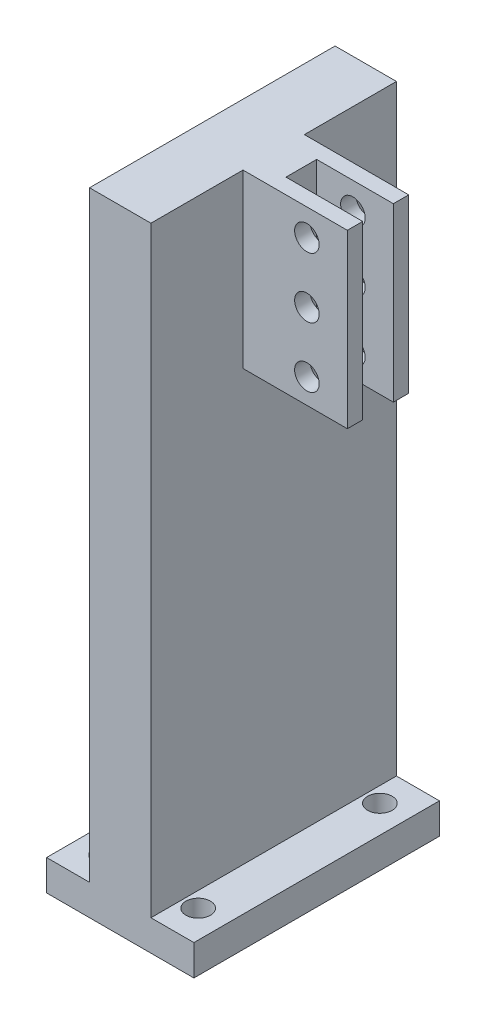
ISO-10303-21;
HEADER;
FILE_DESCRIPTION(('STEP AP214'),'2;1');
FILE_NAME('part.step','',(''),(''),'','','');
FILE_SCHEMA(('AUTOMOTIVE_DESIGN { 1 0 10303 214 1 1 1 1 }'));
ENDSEC;
DATA;
#1=APPLICATION_CONTEXT('core data for automotive mechanical design processes');
#2=APPLICATION_PROTOCOL_DEFINITION('international standard','automotive_design',2000,#1);
#3=PRODUCT_CONTEXT('',#1,'mechanical');
#4=PRODUCT('Part','Part','',(#3));
#5=PRODUCT_RELATED_PRODUCT_CATEGORY('part','',(#4));
#6=PRODUCT_DEFINITION_FORMATION('','',#4);
#7=PRODUCT_DEFINITION_CONTEXT('part definition',#1,'design');
#8=PRODUCT_DEFINITION('design','',#6,#7);
#9=PRODUCT_DEFINITION_SHAPE('','',#8);
#10=(LENGTH_UNIT() NAMED_UNIT(*) SI_UNIT(.MILLI.,.METRE.));
#11=(NAMED_UNIT(*) PLANE_ANGLE_UNIT() SI_UNIT($,.RADIAN.));
#12=(NAMED_UNIT(*) SI_UNIT($,.STERADIAN.) SOLID_ANGLE_UNIT());
#13=UNCERTAINTY_MEASURE_WITH_UNIT(LENGTH_MEASURE(1.E-05),#10,'distance_accuracy_value','');
#14=(GEOMETRIC_REPRESENTATION_CONTEXT(3) GLOBAL_UNCERTAINTY_ASSIGNED_CONTEXT((#13)) GLOBAL_UNIT_ASSIGNED_CONTEXT((#10,
#11,#12)) REPRESENTATION_CONTEXT('',''));
#15=CARTESIAN_POINT('',(0.,0.,0.));
#16=DIRECTION('',(0.,0.,1.));
#17=DIRECTION('',(1.,0.,0.));
#18=AXIS2_PLACEMENT_3D('',#15,#16,#17);
#19=CARTESIAN_POINT('',(0.,103.,0.));
#20=DIRECTION('',(0.,1.,0.));
#21=DIRECTION('',(0.,0.,1.));
#22=AXIS2_PLACEMENT_3D('',#19,#20,#21);
#23=PLANE('',#22);
#24=DIRECTION('',(0.,0.,1.));
#25=VECTOR('',#24,1.);
#26=CARTESIAN_POINT('',(9.5,103.,-2.));
#27=LINE('',#26,#25);
#28=CARTESIAN_POINT('',(9.5,103.,-2.5));
#29=VERTEX_POINT('',#28);
#30=CARTESIAN_POINT('',(9.5,103.,2.5));
#31=VERTEX_POINT('',#30);
#32=EDGE_CURVE('E160',#29,#31,#27,.T.);
#33=ORIENTED_EDGE('',*,*,#32,.F.);
#34=DIRECTION('',(-1.,0.,0.));
#35=VECTOR('',#34,1.);
#36=CARTESIAN_POINT('',(9.5,103.,-2.5));
#37=LINE('',#36,#35);
#38=CARTESIAN_POINT('',(22.,103.,-2.5));
#39=VERTEX_POINT('',#38);
#40=EDGE_CURVE('E151',#39,#29,#37,.T.);
#41=ORIENTED_EDGE('',*,*,#40,.F.);
#42=DIRECTION('',(0.,0.,1.));
#43=VECTOR('',#42,1.);
#44=CARTESIAN_POINT('',(22.,103.,5.));
#45=LINE('',#44,#43);
#46=CARTESIAN_POINT('',(22.,103.,-5.));
#47=VERTEX_POINT('',#46);
#48=EDGE_CURVE('E158',#47,#39,#45,.T.);
#49=ORIENTED_EDGE('',*,*,#48,.F.);
#50=DIRECTION('',(-1.,0.,0.));
#51=VECTOR('',#50,1.);
#52=CARTESIAN_POINT('',(23.5,103.,-5.));
#53=LINE('',#52,#51);
#54=CARTESIAN_POINT('',(5.,103.,-5.));
#55=VERTEX_POINT('',#54);
#56=EDGE_CURVE('E208',#47,#55,#53,.T.);
#57=ORIENTED_EDGE('',*,*,#56,.T.);
#58=DIRECTION('',(0.,0.,-1.));
#59=VECTOR('',#58,1.);
#60=CARTESIAN_POINT('',(5.,103.,20.));
#61=LINE('',#60,#59);
#62=CARTESIAN_POINT('',(5.,103.,-20.));
#63=VERTEX_POINT('',#62);
#64=EDGE_CURVE('E214',#55,#63,#61,.T.);
#65=ORIENTED_EDGE('',*,*,#64,.T.);
#66=DIRECTION('',(-1.,0.,0.));
#67=VECTOR('',#66,1.);
#68=CARTESIAN_POINT('',(5.,103.,-20.));
#69=LINE('',#68,#67);
#70=CARTESIAN_POINT('',(-5.,103.,-20.));
#71=VERTEX_POINT('',#70);
#72=EDGE_CURVE('E219',#63,#71,#69,.T.);
#73=ORIENTED_EDGE('',*,*,#72,.T.);
#74=DIRECTION('',(0.,0.,1.));
#75=VECTOR('',#74,1.);
#76=CARTESIAN_POINT('',(-5.,103.,-20.));
#77=LINE('',#76,#75);
#78=CARTESIAN_POINT('',(-5.,103.,20.));
#79=VERTEX_POINT('',#78);
#80=EDGE_CURVE('E221',#71,#79,#77,.T.);
#81=ORIENTED_EDGE('',*,*,#80,.T.);
#82=DIRECTION('',(1.,0.,0.));
#83=VECTOR('',#82,1.);
#84=CARTESIAN_POINT('',(-5.,103.,20.));
#85=LINE('',#84,#83);
#86=CARTESIAN_POINT('',(5.,103.,20.));
#87=VERTEX_POINT('',#86);
#88=EDGE_CURVE('E211',#79,#87,#85,.T.);
#89=ORIENTED_EDGE('',*,*,#88,.T.);
#90=CARTESIAN_POINT('',(5.,103.,5.));
#91=VERTEX_POINT('',#90);
#92=EDGE_CURVE('E216',#87,#91,#61,.T.);
#93=ORIENTED_EDGE('',*,*,#92,.T.);
#94=DIRECTION('',(-1.,0.,0.));
#95=VECTOR('',#94,1.);
#96=CARTESIAN_POINT('',(23.5,103.,5.));
#97=LINE('',#96,#95);
#98=CARTESIAN_POINT('',(22.,103.,5.));
#99=VERTEX_POINT('',#98);
#100=EDGE_CURVE('E206',#99,#91,#97,.T.);
#101=ORIENTED_EDGE('',*,*,#100,.F.);
#102=CARTESIAN_POINT('',(22.,103.,2.5));
#103=VERTEX_POINT('',#102);
#104=EDGE_CURVE('E168',#103,#99,#45,.T.);
#105=ORIENTED_EDGE('',*,*,#104,.F.);
#106=DIRECTION('',(1.,0.,0.));
#107=VECTOR('',#106,1.);
#108=CARTESIAN_POINT('',(9.5,103.,2.5));
#109=LINE('',#108,#107);
#110=EDGE_CURVE('E52',#31,#103,#109,.T.);
#111=ORIENTED_EDGE('',*,*,#110,.F.);
#112=EDGE_LOOP('',(#33,#41,#49,#57,#65,#73,#81,#89,#93,#101,#105,#111));
#113=FACE_BOUND('',#112,.T.);
#114=ADVANCED_FACE('F37',(#113),#23,.T.);
#115=CARTESIAN_POINT('',(23.5,75.,-5.));
#116=DIRECTION('',(0.,1.,0.));
#117=DIRECTION('',(0.,0.,1.));
#118=AXIS2_PLACEMENT_3D('',#115,#116,#117);
#119=PLANE('',#118);
#120=DIRECTION('',(-1.,0.,0.));
#121=VECTOR('',#120,1.);
#122=CARTESIAN_POINT('',(23.5,75.,-2.5));
#123=LINE('',#122,#121);
#124=CARTESIAN_POINT('',(22.,75.,-2.5));
#125=VERTEX_POINT('',#124);
#126=CARTESIAN_POINT('',(9.5,75.,-2.5));
#127=VERTEX_POINT('',#126);
#128=EDGE_CURVE('E59',#125,#127,#123,.T.);
#129=ORIENTED_EDGE('',*,*,#128,.T.);
#130=DIRECTION('',(0.,0.,1.));
#131=VECTOR('',#130,1.);
#132=CARTESIAN_POINT('',(9.5,75.,-5.));
#133=LINE('',#132,#131);
#134=CARTESIAN_POINT('',(9.5,75.,2.5));
#135=VERTEX_POINT('',#134);
#136=EDGE_CURVE('E155',#127,#135,#133,.T.);
#137=ORIENTED_EDGE('',*,*,#136,.T.);
#138=DIRECTION('',(1.,0.,0.));
#139=VECTOR('',#138,1.);
#140=CARTESIAN_POINT('',(23.5,75.,2.5));
#141=LINE('',#140,#139);
#142=CARTESIAN_POINT('',(22.,75.,2.5));
#143=VERTEX_POINT('',#142);
#144=EDGE_CURVE('E172',#135,#143,#141,.T.);
#145=ORIENTED_EDGE('',*,*,#144,.T.);
#146=DIRECTION('',(0.,0.,1.));
#147=VECTOR('',#146,1.);
#148=CARTESIAN_POINT('',(22.,75.,-5.));
#149=LINE('',#148,#147);
#150=CARTESIAN_POINT('',(22.,75.,5.));
#151=VERTEX_POINT('',#150);
#152=EDGE_CURVE('E178',#143,#151,#149,.T.);
#153=ORIENTED_EDGE('',*,*,#152,.T.);
#154=DIRECTION('',(-1.,0.,0.));
#155=VECTOR('',#154,1.);
#156=CARTESIAN_POINT('',(23.5,75.,5.));
#157=LINE('',#156,#155);
#158=CARTESIAN_POINT('',(5.,75.,5.));
#159=VERTEX_POINT('',#158);
#160=EDGE_CURVE('E204',#151,#159,#157,.T.);
#161=ORIENTED_EDGE('',*,*,#160,.T.);
#162=DIRECTION('',(0.,0.,-1.));
#163=VECTOR('',#162,1.);
#164=CARTESIAN_POINT('',(5.,75.,-5.));
#165=LINE('',#164,#163);
#166=CARTESIAN_POINT('',(5.,75.,-5.));
#167=VERTEX_POINT('',#166);
#168=EDGE_CURVE('E199',#159,#167,#165,.T.);
#169=ORIENTED_EDGE('',*,*,#168,.T.);
#170=DIRECTION('',(-1.,0.,0.));
#171=VECTOR('',#170,1.);
#172=CARTESIAN_POINT('',(23.5,75.,-5.));
#173=LINE('',#172,#171);
#174=CARTESIAN_POINT('',(22.,75.,-5.));
#175=VERTEX_POINT('',#174);
#176=EDGE_CURVE('E202',#175,#167,#173,.T.);
#177=ORIENTED_EDGE('',*,*,#176,.F.);
#178=EDGE_CURVE('E180',#175,#125,#149,.T.);
#179=ORIENTED_EDGE('',*,*,#178,.T.);
#180=EDGE_LOOP('',(#129,#137,#145,#153,#161,#169,#177,#179));
#181=FACE_BOUND('',#180,.T.);
#182=ADVANCED_FACE('F304',(#181),#119,.F.);
#183=CARTESIAN_POINT('',(15.41,79.03,19.25));
#184=DIRECTION('',(0.,0.,-1.));
#185=DIRECTION('',(0.,1.,0.));
#186=AXIS2_PLACEMENT_3D('',#183,#184,#185);
#187=CYLINDRICAL_SURFACE('',#186,2.);
#188=CARTESIAN_POINT('',(15.41,79.03,-2.5));
#189=DIRECTION('',(0.,0.,-1.));
#190=DIRECTION('',(-1.,0.,0.));
#191=AXIS2_PLACEMENT_3D('',#188,#189,#190);
#192=CIRCLE('',#191,2.);
#193=CARTESIAN_POINT('',(13.41,79.03,-2.5));
#194=VERTEX_POINT('',#193);
#195=EDGE_CURVE('E321',#194,#194,#192,.F.);
#196=ORIENTED_EDGE('',*,*,#195,.T.);
#197=EDGE_LOOP('',(#196));
#198=FACE_BOUND('',#197,.T.);
#199=CARTESIAN_POINT('',(15.41,79.03,-5.));
#200=DIRECTION('',(0.,0.,1.));
#201=DIRECTION('',(0.,-1.,0.));
#202=AXIS2_PLACEMENT_3D('',#199,#200,#201);
#203=CIRCLE('',#202,2.);
#204=CARTESIAN_POINT('',(15.41,77.03,-5.));
#205=VERTEX_POINT('',#204);
#206=EDGE_CURVE('E181',#205,#205,#203,.T.);
#207=ORIENTED_EDGE('',*,*,#206,.F.);
#208=EDGE_LOOP('',(#207));
#209=FACE_BOUND('',#208,.T.);
#210=ADVANCED_FACE('F353',(#198,#209),#187,.F.);
#211=CARTESIAN_POINT('',(15.41,88.85,19.25));
#212=DIRECTION('',(0.,0.,-1.));
#213=DIRECTION('',(0.,1.,0.));
#214=AXIS2_PLACEMENT_3D('',#211,#212,#213);
#215=CYLINDRICAL_SURFACE('',#214,2.);
#216=CARTESIAN_POINT('',(15.41,88.85,-2.5));
#217=DIRECTION('',(0.,0.,-1.));
#218=DIRECTION('',(-1.,0.,0.));
#219=AXIS2_PLACEMENT_3D('',#216,#217,#218);
#220=CIRCLE('',#219,2.);
#221=CARTESIAN_POINT('',(13.41,88.85,-2.5));
#222=VERTEX_POINT('',#221);
#223=EDGE_CURVE('E318',#222,#222,#220,.F.);
#224=ORIENTED_EDGE('',*,*,#223,.T.);
#225=EDGE_LOOP('',(#224));
#226=FACE_BOUND('',#225,.T.);
#227=CARTESIAN_POINT('',(15.41,88.85,-5.));
#228=DIRECTION('',(0.,0.,1.));
#229=DIRECTION('',(0.,-1.,0.));
#230=AXIS2_PLACEMENT_3D('',#227,#228,#229);
#231=CIRCLE('',#230,2.);
#232=CARTESIAN_POINT('',(15.41,86.85,-5.));
#233=VERTEX_POINT('',#232);
#234=EDGE_CURVE('E186',#233,#233,#231,.T.);
#235=ORIENTED_EDGE('',*,*,#234,.F.);
#236=EDGE_LOOP('',(#235));
#237=FACE_BOUND('',#236,.T.);
#238=ADVANCED_FACE('F459',(#226,#237),#215,.F.);
#239=CARTESIAN_POINT('',(15.41,98.67,19.25));
#240=DIRECTION('',(0.,0.,-1.));
#241=DIRECTION('',(0.,1.,0.));
#242=AXIS2_PLACEMENT_3D('',#239,#240,#241);
#243=CYLINDRICAL_SURFACE('',#242,2.);
#244=CARTESIAN_POINT('',(15.41,98.67,-2.5));
#245=DIRECTION('',(0.,0.,-1.));
#246=DIRECTION('',(-1.,0.,0.));
#247=AXIS2_PLACEMENT_3D('',#244,#245,#246);
#248=CIRCLE('',#247,2.);
#249=CARTESIAN_POINT('',(13.41,98.67,-2.5));
#250=VERTEX_POINT('',#249);
#251=EDGE_CURVE('E315',#250,#250,#248,.F.);
#252=ORIENTED_EDGE('',*,*,#251,.T.);
#253=EDGE_LOOP('',(#252));
#254=FACE_BOUND('',#253,.T.);
#255=CARTESIAN_POINT('',(15.41,98.67,-5.));
#256=DIRECTION('',(0.,0.,1.));
#257=DIRECTION('',(0.,-1.,0.));
#258=AXIS2_PLACEMENT_3D('',#255,#256,#257);
#259=CIRCLE('',#258,2.);
#260=CARTESIAN_POINT('',(15.41,96.67,-5.));
#261=VERTEX_POINT('',#260);
#262=EDGE_CURVE('E190',#261,#261,#259,.T.);
#263=ORIENTED_EDGE('',*,*,#262,.F.);
#264=EDGE_LOOP('',(#263));
#265=FACE_BOUND('',#264,.T.);
#266=ADVANCED_FACE('F368',(#254,#265),#243,.F.);
#267=CARTESIAN_POINT('',(5.,103.,20.));
#268=DIRECTION('',(-1.,0.,0.));
#269=DIRECTION('',(0.,0.,1.));
#270=AXIS2_PLACEMENT_3D('',#267,#268,#269);
#271=PLANE('',#270);
#272=DIRECTION('',(0.,1.,0.));
#273=VECTOR('',#272,1.);
#274=CARTESIAN_POINT('',(5.,103.,-5.));
#275=LINE('',#274,#273);
#276=EDGE_CURVE('E193',#167,#55,#275,.T.);
#277=ORIENTED_EDGE('',*,*,#276,.F.);
#278=ORIENTED_EDGE('',*,*,#168,.F.);
#279=DIRECTION('',(0.,-1.,0.));
#280=VECTOR('',#279,1.);
#281=CARTESIAN_POINT('',(5.,75.,5.));
#282=LINE('',#281,#280);
#283=EDGE_CURVE('E196',#91,#159,#282,.T.);
#284=ORIENTED_EDGE('',*,*,#283,.F.);
#285=ORIENTED_EDGE('',*,*,#92,.F.);
#286=DIRECTION('',(0.,-1.,0.));
#287=VECTOR('',#286,1.);
#288=CARTESIAN_POINT('',(5.,103.,20.));
#289=LINE('',#288,#287);
#290=CARTESIAN_POINT('',(5.,5.,20.));
#291=VERTEX_POINT('',#290);
#292=EDGE_CURVE('E236',#87,#291,#289,.T.);
#293=ORIENTED_EDGE('',*,*,#292,.T.);
#294=DIRECTION('',(0.,0.,-1.));
#295=VECTOR('',#294,1.);
#296=CARTESIAN_POINT('',(5.,5.,20.));
#297=LINE('',#296,#295);
#298=CARTESIAN_POINT('',(5.,5.,-20.));
#299=VERTEX_POINT('',#298);
#300=EDGE_CURVE('E210',#291,#299,#297,.T.);
#301=ORIENTED_EDGE('',*,*,#300,.T.);
#302=DIRECTION('',(0.,-1.,0.));
#303=VECTOR('',#302,1.);
#304=CARTESIAN_POINT('',(5.,103.,-20.));
#305=LINE('',#304,#303);
#306=EDGE_CURVE('E233',#63,#299,#305,.T.);
#307=ORIENTED_EDGE('',*,*,#306,.F.);
#308=ORIENTED_EDGE('',*,*,#64,.F.);
#309=EDGE_LOOP('',(#277,#278,#284,#285,#293,#301,#307,#308));
#310=FACE_BOUND('',#309,.T.);
#311=ADVANCED_FACE('F364',(#310),#271,.F.);
#312=CARTESIAN_POINT('',(0.,5.,0.));
#313=DIRECTION('',(0.,1.,0.));
#314=DIRECTION('',(0.,0.,1.));
#315=AXIS2_PLACEMENT_3D('',#312,#313,#314);
#316=PLANE('',#315);
#317=DIRECTION('',(0.,0.,1.));
#318=VECTOR('',#317,1.);
#319=CARTESIAN_POINT('',(-5.,5.,0.));
#320=LINE('',#319,#318);
#321=CARTESIAN_POINT('',(-4.99999999999999,5.,-20.));
#322=VERTEX_POINT('',#321);
#323=CARTESIAN_POINT('',(-5.,5.,20.));
#324=VERTEX_POINT('',#323);
#325=EDGE_CURVE('E215',#322,#324,#320,.T.);
#326=ORIENTED_EDGE('',*,*,#325,.F.);
#327=DIRECTION('',(-1.,0.,0.));
#328=VECTOR('',#327,1.);
#329=CARTESIAN_POINT('',(12.,5.,-20.));
#330=LINE('',#329,#328);
#331=CARTESIAN_POINT('',(-12.,5.,-20.));
#332=VERTEX_POINT('',#331);
#333=EDGE_CURVE('E267',#322,#332,#330,.T.);
#334=ORIENTED_EDGE('',*,*,#333,.T.);
#335=DIRECTION('',(0.,0.,1.));
#336=VECTOR('',#335,1.);
#337=CARTESIAN_POINT('',(-12.,5.,20.));
#338=LINE('',#337,#336);
#339=CARTESIAN_POINT('',(-12.,5.,20.));
#340=VERTEX_POINT('',#339);
#341=EDGE_CURVE('E271',#332,#340,#338,.T.);
#342=ORIENTED_EDGE('',*,*,#341,.T.);
#343=DIRECTION('',(1.,0.,0.));
#344=VECTOR('',#343,1.);
#345=CARTESIAN_POINT('',(12.,5.,20.));
#346=LINE('',#345,#344);
#347=EDGE_CURVE('E274',#340,#324,#346,.T.);
#348=ORIENTED_EDGE('',*,*,#347,.T.);
#349=EDGE_LOOP('',(#326,#334,#342,#348));
#350=FACE_BOUND('',#349,.T.);
#351=CARTESIAN_POINT('',(-7.5,5.,14.8));
#352=DIRECTION('',(0.,1.,0.));
#353=DIRECTION('',(0.,0.,1.));
#354=AXIS2_PLACEMENT_3D('',#351,#352,#353);
#355=CIRCLE('',#354,2.);
#356=CARTESIAN_POINT('',(-7.5,5.,16.8));
#357=VERTEX_POINT('',#356);
#358=EDGE_CURVE('E252',#357,#357,#355,.T.);
#359=ORIENTED_EDGE('',*,*,#358,.F.);
#360=EDGE_LOOP('',(#359));
#361=FACE_BOUND('',#360,.T.);
#362=CARTESIAN_POINT('',(-7.5,5.,-14.8));
#363=DIRECTION('',(0.,1.,0.));
#364=DIRECTION('',(0.,0.,-1.));
#365=AXIS2_PLACEMENT_3D('',#362,#363,#364);
#366=CIRCLE('',#365,2.);
#367=CARTESIAN_POINT('',(-7.5,5.,-16.8));
#368=VERTEX_POINT('',#367);
#369=EDGE_CURVE('E246',#368,#368,#366,.T.);
#370=ORIENTED_EDGE('',*,*,#369,.F.);
#371=EDGE_LOOP('',(#370));
#372=FACE_BOUND('',#371,.T.);
#373=ADVANCED_FACE('F367',(#350,#361,#372),#316,.T.);
#374=ORIENTED_EDGE('',*,*,#300,.F.);
#375=CARTESIAN_POINT('',(12.,5.,20.));
#376=VERTEX_POINT('',#375);
#377=EDGE_CURVE('E273',#291,#376,#346,.T.);
#378=ORIENTED_EDGE('',*,*,#377,.T.);
#379=DIRECTION('',(0.,0.,-1.));
#380=VECTOR('',#379,1.);
#381=CARTESIAN_POINT('',(12.,5.,20.));
#382=LINE('',#381,#380);
#383=CARTESIAN_POINT('',(12.,5.,-20.));
#384=VERTEX_POINT('',#383);
#385=EDGE_CURVE('E264',#376,#384,#382,.T.);
#386=ORIENTED_EDGE('',*,*,#385,.T.);
#387=EDGE_CURVE('E269',#384,#299,#330,.T.);
#388=ORIENTED_EDGE('',*,*,#387,.T.);
#389=EDGE_LOOP('',(#374,#378,#386,#388));
#390=FACE_BOUND('',#389,.T.);
#391=CARTESIAN_POINT('',(7.5,5.,14.8));
#392=DIRECTION('',(0.,1.,0.));
#393=DIRECTION('',(0.,0.,1.));
#394=AXIS2_PLACEMENT_3D('',#391,#392,#393);
#395=CIRCLE('',#394,2.);
#396=CARTESIAN_POINT('',(7.5,5.,16.8));
#397=VERTEX_POINT('',#396);
#398=EDGE_CURVE('E258',#397,#397,#395,.T.);
#399=ORIENTED_EDGE('',*,*,#398,.F.);
#400=EDGE_LOOP('',(#399));
#401=FACE_BOUND('',#400,.T.);
#402=CARTESIAN_POINT('',(7.5,5.,-14.8));
#403=DIRECTION('',(0.,1.,0.));
#404=DIRECTION('',(0.,0.,-1.));
#405=AXIS2_PLACEMENT_3D('',#402,#403,#404);
#406=CIRCLE('',#405,2.);
#407=CARTESIAN_POINT('',(7.5,5.,-16.8));
#408=VERTEX_POINT('',#407);
#409=EDGE_CURVE('E240',#408,#408,#406,.T.);
#410=ORIENTED_EDGE('',*,*,#409,.F.);
#411=EDGE_LOOP('',(#410));
#412=FACE_BOUND('',#411,.T.);
#413=ADVANCED_FACE('F386',(#390,#401,#412),#316,.T.);
#414=CARTESIAN_POINT('',(0.,0.,0.));
#415=DIRECTION('',(0.,1.,0.));
#416=DIRECTION('',(0.,0.,1.));
#417=AXIS2_PLACEMENT_3D('',#414,#415,#416);
#418=PLANE('',#417);
#419=DIRECTION('',(0.,0.,-1.));
#420=VECTOR('',#419,1.);
#421=CARTESIAN_POINT('',(12.,0.,20.));
#422=LINE('',#421,#420);
#423=CARTESIAN_POINT('',(12.,0.,20.));
#424=VERTEX_POINT('',#423);
#425=CARTESIAN_POINT('',(12.,0.,-20.));
#426=VERTEX_POINT('',#425);
#427=EDGE_CURVE('E261',#424,#426,#422,.T.);
#428=ORIENTED_EDGE('',*,*,#427,.F.);
#429=DIRECTION('',(1.,0.,0.));
#430=VECTOR('',#429,1.);
#431=CARTESIAN_POINT('',(12.,0.,20.));
#432=LINE('',#431,#430);
#433=CARTESIAN_POINT('',(-12.,0.,20.));
#434=VERTEX_POINT('',#433);
#435=EDGE_CURVE('E268',#434,#424,#432,.T.);
#436=ORIENTED_EDGE('',*,*,#435,.F.);
#437=DIRECTION('',(0.,0.,1.));
#438=VECTOR('',#437,1.);
#439=CARTESIAN_POINT('',(-12.,0.,20.));
#440=LINE('',#439,#438);
#441=CARTESIAN_POINT('',(-12.,0.,-20.));
#442=VERTEX_POINT('',#441);
#443=EDGE_CURVE('E281',#442,#434,#440,.T.);
#444=ORIENTED_EDGE('',*,*,#443,.F.);
#445=DIRECTION('',(-1.,0.,0.));
#446=VECTOR('',#445,1.);
#447=CARTESIAN_POINT('',(12.,0.,-20.));
#448=LINE('',#447,#446);
#449=EDGE_CURVE('E279',#426,#442,#448,.T.);
#450=ORIENTED_EDGE('',*,*,#449,.F.);
#451=EDGE_LOOP('',(#428,#436,#444,#450));
#452=FACE_BOUND('',#451,.T.);
#453=CARTESIAN_POINT('',(7.5,0.,14.8));
#454=DIRECTION('',(0.,1.,0.));
#455=DIRECTION('',(0.,0.,1.));
#456=AXIS2_PLACEMENT_3D('',#453,#454,#455);
#457=CIRCLE('',#456,2.);
#458=CARTESIAN_POINT('',(7.5,0.,16.8));
#459=VERTEX_POINT('',#458);
#460=EDGE_CURVE('E255',#459,#459,#457,.T.);
#461=ORIENTED_EDGE('',*,*,#460,.T.);
#462=EDGE_LOOP('',(#461));
#463=FACE_BOUND('',#462,.T.);
#464=CARTESIAN_POINT('',(-7.5,0.,14.8));
#465=DIRECTION('',(0.,1.,0.));
#466=DIRECTION('',(0.,0.,1.));
#467=AXIS2_PLACEMENT_3D('',#464,#465,#466);
#468=CIRCLE('',#467,2.);
#469=CARTESIAN_POINT('',(-7.5,0.,16.8));
#470=VERTEX_POINT('',#469);
#471=EDGE_CURVE('E249',#470,#470,#468,.T.);
#472=ORIENTED_EDGE('',*,*,#471,.T.);
#473=EDGE_LOOP('',(#472));
#474=FACE_BOUND('',#473,.T.);
#475=CARTESIAN_POINT('',(-7.5,0.,-14.8));
#476=DIRECTION('',(0.,1.,0.));
#477=DIRECTION('',(0.,0.,-1.));
#478=AXIS2_PLACEMENT_3D('',#475,#476,#477);
#479=CIRCLE('',#478,2.);
#480=CARTESIAN_POINT('',(-7.5,0.,-16.8));
#481=VERTEX_POINT('',#480);
#482=EDGE_CURVE('E243',#481,#481,#479,.T.);
#483=ORIENTED_EDGE('',*,*,#482,.T.);
#484=EDGE_LOOP('',(#483));
#485=FACE_BOUND('',#484,.T.);
#486=CARTESIAN_POINT('',(7.5,0.,-14.8));
#487=DIRECTION('',(0.,1.,0.));
#488=DIRECTION('',(0.,0.,-1.));
#489=AXIS2_PLACEMENT_3D('',#486,#487,#488);
#490=CIRCLE('',#489,2.);
#491=CARTESIAN_POINT('',(7.5,0.,-16.8));
#492=VERTEX_POINT('',#491);
#493=EDGE_CURVE('E239',#492,#492,#490,.T.);
#494=ORIENTED_EDGE('',*,*,#493,.T.);
#495=EDGE_LOOP('',(#494));
#496=FACE_BOUND('',#495,.T.);
#497=ADVANCED_FACE('F389',(#452,#463,#474,#485,#496),#418,.F.);
#498=CARTESIAN_POINT('',(12.,5.,20.));
#499=DIRECTION('',(-1.,0.,0.));
#500=DIRECTION('',(0.,0.,1.));
#501=AXIS2_PLACEMENT_3D('',#498,#499,#500);
#502=PLANE('',#501);
#503=ORIENTED_EDGE('',*,*,#427,.T.);
#504=DIRECTION('',(0.,-1.,0.));
#505=VECTOR('',#504,1.);
#506=CARTESIAN_POINT('',(12.,5.,-20.));
#507=LINE('',#506,#505);
#508=EDGE_CURVE('E292',#384,#426,#507,.T.);
#509=ORIENTED_EDGE('',*,*,#508,.F.);
#510=ORIENTED_EDGE('',*,*,#385,.F.);
#511=DIRECTION('',(0.,-1.,0.));
#512=VECTOR('',#511,1.);
#513=CARTESIAN_POINT('',(12.,5.,20.));
#514=LINE('',#513,#512);
#515=EDGE_CURVE('E276',#376,#424,#514,.T.);
#516=ORIENTED_EDGE('',*,*,#515,.T.);
#517=EDGE_LOOP('',(#503,#509,#510,#516));
#518=FACE_BOUND('',#517,.T.);
#519=ADVANCED_FACE('F39',(#518),#502,.F.);
#520=CARTESIAN_POINT('',(12.,5.,-20.));
#521=DIRECTION('',(0.,0.,1.));
#522=DIRECTION('',(1.,0.,0.));
#523=AXIS2_PLACEMENT_3D('',#520,#521,#522);
#524=PLANE('',#523);
#525=ORIENTED_EDGE('',*,*,#449,.T.);
#526=DIRECTION('',(0.,-1.,0.));
#527=VECTOR('',#526,1.);
#528=CARTESIAN_POINT('',(-12.,5.,-20.));
#529=LINE('',#528,#527);
#530=EDGE_CURVE('E289',#332,#442,#529,.T.);
#531=ORIENTED_EDGE('',*,*,#530,.F.);
#532=ORIENTED_EDGE('',*,*,#333,.F.);
#533=DIRECTION('',(0.,-1.,0.));
#534=VECTOR('',#533,1.);
#535=CARTESIAN_POINT('',(-5.,103.,-20.));
#536=LINE('',#535,#534);
#537=EDGE_CURVE('E230',#71,#322,#536,.T.);
#538=ORIENTED_EDGE('',*,*,#537,.F.);
#539=ORIENTED_EDGE('',*,*,#72,.F.);
#540=ORIENTED_EDGE('',*,*,#306,.T.);
#541=ORIENTED_EDGE('',*,*,#387,.F.);
#542=ORIENTED_EDGE('',*,*,#508,.T.);
#543=EDGE_LOOP('',(#525,#531,#532,#538,#539,#540,#541,#542));
#544=FACE_BOUND('',#543,.T.);
#545=ADVANCED_FACE('F399',(#544),#524,.F.);
#546=CARTESIAN_POINT('',(-12.,5.,20.));
#547=DIRECTION('',(1.,0.,0.));
#548=DIRECTION('',(0.,0.,-1.));
#549=AXIS2_PLACEMENT_3D('',#546,#547,#548);
#550=PLANE('',#549);
#551=ORIENTED_EDGE('',*,*,#443,.T.);
#552=DIRECTION('',(0.,-1.,0.));
#553=VECTOR('',#552,1.);
#554=CARTESIAN_POINT('',(-12.,5.,20.));
#555=LINE('',#554,#553);
#556=EDGE_CURVE('E286',#340,#434,#555,.T.);
#557=ORIENTED_EDGE('',*,*,#556,.F.);
#558=ORIENTED_EDGE('',*,*,#341,.F.);
#559=ORIENTED_EDGE('',*,*,#530,.T.);
#560=EDGE_LOOP('',(#551,#557,#558,#559));
#561=FACE_BOUND('',#560,.T.);
#562=ADVANCED_FACE('F396',(#561),#550,.F.);
#563=CARTESIAN_POINT('',(12.,5.,20.));
#564=DIRECTION('',(0.,0.,-1.));
#565=DIRECTION('',(-1.,0.,0.));
#566=AXIS2_PLACEMENT_3D('',#563,#564,#565);
#567=PLANE('',#566);
#568=ORIENTED_EDGE('',*,*,#435,.T.);
#569=ORIENTED_EDGE('',*,*,#515,.F.);
#570=ORIENTED_EDGE('',*,*,#377,.F.);
#571=ORIENTED_EDGE('',*,*,#292,.F.);
#572=ORIENTED_EDGE('',*,*,#88,.F.);
#573=DIRECTION('',(0.,-1.,0.));
#574=VECTOR('',#573,1.);
#575=CARTESIAN_POINT('',(-5.,103.,20.));
#576=LINE('',#575,#574);
#577=EDGE_CURVE('E223',#79,#324,#576,.T.);
#578=ORIENTED_EDGE('',*,*,#577,.T.);
#579=ORIENTED_EDGE('',*,*,#347,.F.);
#580=ORIENTED_EDGE('',*,*,#556,.T.);
#581=EDGE_LOOP('',(#568,#569,#570,#571,#572,#578,#579,#580));
#582=FACE_BOUND('',#581,.T.);
#583=ADVANCED_FACE('F384',(#582),#567,.F.);
#584=CARTESIAN_POINT('',(7.5,5.,14.8));
#585=DIRECTION('',(0.,-1.,0.));
#586=DIRECTION('',(0.,0.,-1.));
#587=AXIS2_PLACEMENT_3D('',#584,#585,#586);
#588=CYLINDRICAL_SURFACE('',#587,2.);
#589=ORIENTED_EDGE('',*,*,#398,.T.);
#590=EDGE_LOOP('',(#589));
#591=FACE_BOUND('',#590,.T.);
#592=ORIENTED_EDGE('',*,*,#460,.F.);
#593=EDGE_LOOP('',(#592));
#594=FACE_BOUND('',#593,.T.);
#595=ADVANCED_FACE('F380',(#591,#594),#588,.F.);
#596=CARTESIAN_POINT('',(-7.5,5.,14.8));
#597=DIRECTION('',(0.,-1.,0.));
#598=DIRECTION('',(0.,0.,-1.));
#599=AXIS2_PLACEMENT_3D('',#596,#597,#598);
#600=CYLINDRICAL_SURFACE('',#599,2.);
#601=ORIENTED_EDGE('',*,*,#358,.T.);
#602=EDGE_LOOP('',(#601));
#603=FACE_BOUND('',#602,.T.);
#604=ORIENTED_EDGE('',*,*,#471,.F.);
#605=EDGE_LOOP('',(#604));
#606=FACE_BOUND('',#605,.T.);
#607=ADVANCED_FACE('F376',(#603,#606),#600,.F.);
#608=CARTESIAN_POINT('',(-7.5,5.,-14.8));
#609=DIRECTION('',(0.,-1.,0.));
#610=DIRECTION('',(0.,0.,-1.));
#611=AXIS2_PLACEMENT_3D('',#608,#609,#610);
#612=CYLINDRICAL_SURFACE('',#611,2.);
#613=ORIENTED_EDGE('',*,*,#369,.T.);
#614=EDGE_LOOP('',(#613));
#615=FACE_BOUND('',#614,.T.);
#616=ORIENTED_EDGE('',*,*,#482,.F.);
#617=EDGE_LOOP('',(#616));
#618=FACE_BOUND('',#617,.T.);
#619=ADVANCED_FACE('F372',(#615,#618),#612,.F.);
#620=CARTESIAN_POINT('',(7.5,5.,-14.8));
#621=DIRECTION('',(0.,-1.,0.));
#622=DIRECTION('',(0.,0.,-1.));
#623=AXIS2_PLACEMENT_3D('',#620,#621,#622);
#624=CYLINDRICAL_SURFACE('',#623,2.);
#625=ORIENTED_EDGE('',*,*,#409,.T.);
#626=EDGE_LOOP('',(#625));
#627=FACE_BOUND('',#626,.T.);
#628=ORIENTED_EDGE('',*,*,#493,.F.);
#629=EDGE_LOOP('',(#628));
#630=FACE_BOUND('',#629,.T.);
#631=ADVANCED_FACE('F362',(#627,#630),#624,.F.);
#632=CARTESIAN_POINT('',(-5.,103.,0.));
#633=DIRECTION('',(1.,0.,0.));
#634=DIRECTION('',(0.,0.,-1.));
#635=AXIS2_PLACEMENT_3D('',#632,#633,#634);
#636=PLANE('',#635);
#637=ORIENTED_EDGE('',*,*,#325,.T.);
#638=ORIENTED_EDGE('',*,*,#577,.F.);
#639=ORIENTED_EDGE('',*,*,#80,.F.);
#640=ORIENTED_EDGE('',*,*,#537,.T.);
#641=EDGE_LOOP('',(#637,#638,#639,#640));
#642=FACE_BOUND('',#641,.T.);
#643=ADVANCED_FACE('F359',(#642),#636,.F.);
#644=CARTESIAN_POINT('',(23.5,103.,-5.));
#645=DIRECTION('',(0.,0.,1.));
#646=DIRECTION('',(0.,-1.,0.));
#647=AXIS2_PLACEMENT_3D('',#644,#645,#646);
#648=PLANE('',#647);
#649=ORIENTED_EDGE('',*,*,#262,.T.);
#650=EDGE_LOOP('',(#649));
#651=FACE_BOUND('',#650,.T.);
#652=ORIENTED_EDGE('',*,*,#234,.T.);
#653=EDGE_LOOP('',(#652));
#654=FACE_BOUND('',#653,.T.);
#655=ORIENTED_EDGE('',*,*,#206,.T.);
#656=EDGE_LOOP('',(#655));
#657=FACE_BOUND('',#656,.T.);
#658=ORIENTED_EDGE('',*,*,#56,.F.);
#659=DIRECTION('',(0.,1.,0.));
#660=VECTOR('',#659,1.);
#661=CARTESIAN_POINT('',(22.,69.,-5.));
#662=LINE('',#661,#660);
#663=EDGE_CURVE('E167',#175,#47,#662,.T.);
#664=ORIENTED_EDGE('',*,*,#663,.F.);
#665=ORIENTED_EDGE('',*,*,#176,.T.);
#666=ORIENTED_EDGE('',*,*,#276,.T.);
#667=EDGE_LOOP('',(#658,#664,#665,#666));
#668=FACE_BOUND('',#667,.T.);
#669=ADVANCED_FACE('F357',(#651,#654,#657,#668),#648,.F.);
#670=CARTESIAN_POINT('',(23.5,75.,5.));
#671=DIRECTION('',(0.,0.,-1.));
#672=DIRECTION('',(0.,1.,0.));
#673=AXIS2_PLACEMENT_3D('',#670,#671,#672);
#674=PLANE('',#673);
#675=CARTESIAN_POINT('',(15.41,98.67,5.));
#676=DIRECTION('',(0.,0.,-1.));
#677=DIRECTION('',(0.,1.,0.));
#678=AXIS2_PLACEMENT_3D('',#675,#676,#677);
#679=CIRCLE('',#678,2.);
#680=CARTESIAN_POINT('',(15.41,100.67,5.));
#681=VERTEX_POINT('',#680);
#682=EDGE_CURVE('E189',#681,#681,#679,.T.);
#683=ORIENTED_EDGE('',*,*,#682,.T.);
#684=EDGE_LOOP('',(#683));
#685=FACE_BOUND('',#684,.T.);
#686=CARTESIAN_POINT('',(15.41,88.85,5.));
#687=DIRECTION('',(0.,0.,-1.));
#688=DIRECTION('',(0.,1.,0.));
#689=AXIS2_PLACEMENT_3D('',#686,#687,#688);
#690=CIRCLE('',#689,2.);
#691=CARTESIAN_POINT('',(15.41,90.85,5.));
#692=VERTEX_POINT('',#691);
#693=EDGE_CURVE('E184',#692,#692,#690,.T.);
#694=ORIENTED_EDGE('',*,*,#693,.T.);
#695=EDGE_LOOP('',(#694));
#696=FACE_BOUND('',#695,.T.);
#697=CARTESIAN_POINT('',(15.41,79.03,5.));
#698=DIRECTION('',(0.,0.,-1.));
#699=DIRECTION('',(0.,1.,0.));
#700=AXIS2_PLACEMENT_3D('',#697,#698,#699);
#701=CIRCLE('',#700,2.);
#702=CARTESIAN_POINT('',(15.41,81.03,5.));
#703=VERTEX_POINT('',#702);
#704=EDGE_CURVE('E185',#703,#703,#701,.T.);
#705=ORIENTED_EDGE('',*,*,#704,.T.);
#706=EDGE_LOOP('',(#705));
#707=FACE_BOUND('',#706,.T.);
#708=ORIENTED_EDGE('',*,*,#160,.F.);
#709=DIRECTION('',(0.,1.,0.));
#710=VECTOR('',#709,1.);
#711=CARTESIAN_POINT('',(22.,69.,5.));
#712=LINE('',#711,#710);
#713=EDGE_CURVE('E170',#151,#99,#712,.T.);
#714=ORIENTED_EDGE('',*,*,#713,.T.);
#715=ORIENTED_EDGE('',*,*,#100,.T.);
#716=ORIENTED_EDGE('',*,*,#283,.T.);
#717=EDGE_LOOP('',(#708,#714,#715,#716));
#718=FACE_BOUND('',#717,.T.);
#719=ADVANCED_FACE('F440',(#685,#696,#707,#718),#674,.F.);
#720=CARTESIAN_POINT('',(15.41,79.03,2.5));
#721=DIRECTION('',(0.,0.,1.));
#722=DIRECTION('',(1.,0.,0.));
#723=AXIS2_PLACEMENT_3D('',#720,#721,#722);
#724=CIRCLE('',#723,2.);
#725=CARTESIAN_POINT('',(17.41,79.03,2.5));
#726=VERTEX_POINT('',#725);
#727=EDGE_CURVE('E309',#726,#726,#724,.F.);
#728=ORIENTED_EDGE('',*,*,#727,.T.);
#729=EDGE_LOOP('',(#728));
#730=FACE_BOUND('',#729,.T.);
#731=ORIENTED_EDGE('',*,*,#704,.F.);
#732=EDGE_LOOP('',(#731));
#733=FACE_BOUND('',#732,.T.);
#734=ADVANCED_FACE('F334',(#730,#733),#187,.F.);
#735=CARTESIAN_POINT('',(15.41,88.85,2.5));
#736=DIRECTION('',(0.,0.,1.));
#737=DIRECTION('',(1.,0.,0.));
#738=AXIS2_PLACEMENT_3D('',#735,#736,#737);
#739=CIRCLE('',#738,2.);
#740=CARTESIAN_POINT('',(17.41,88.85,2.5));
#741=VERTEX_POINT('',#740);
#742=EDGE_CURVE('E328',#741,#741,#739,.F.);
#743=ORIENTED_EDGE('',*,*,#742,.T.);
#744=EDGE_LOOP('',(#743));
#745=FACE_BOUND('',#744,.T.);
#746=ORIENTED_EDGE('',*,*,#693,.F.);
#747=EDGE_LOOP('',(#746));
#748=FACE_BOUND('',#747,.T.);
#749=ADVANCED_FACE('F454',(#745,#748),#215,.F.);
#750=CARTESIAN_POINT('',(15.41,98.67,2.5));
#751=DIRECTION('',(0.,0.,1.));
#752=DIRECTION('',(1.,0.,0.));
#753=AXIS2_PLACEMENT_3D('',#750,#751,#752);
#754=CIRCLE('',#753,2.);
#755=CARTESIAN_POINT('',(17.41,98.67,2.5));
#756=VERTEX_POINT('',#755);
#757=EDGE_CURVE('E325',#756,#756,#754,.F.);
#758=ORIENTED_EDGE('',*,*,#757,.T.);
#759=EDGE_LOOP('',(#758));
#760=FACE_BOUND('',#759,.T.);
#761=ORIENTED_EDGE('',*,*,#682,.F.);
#762=EDGE_LOOP('',(#761));
#763=FACE_BOUND('',#762,.T.);
#764=ADVANCED_FACE('F450',(#760,#763),#243,.F.);
#765=CARTESIAN_POINT('',(9.5,69.,-2.));
#766=DIRECTION('',(-1.,0.,0.));
#767=DIRECTION('',(0.,0.,1.));
#768=AXIS2_PLACEMENT_3D('',#765,#766,#767);
#769=PLANE('',#768);
#770=ORIENTED_EDGE('',*,*,#136,.F.);
#771=DIRECTION('',(0.,1.,0.));
#772=VECTOR('',#771,1.);
#773=CARTESIAN_POINT('',(9.5,69.,-2.5));
#774=LINE('',#773,#772);
#775=EDGE_CURVE('E162',#127,#29,#774,.T.);
#776=ORIENTED_EDGE('',*,*,#775,.T.);
#777=ORIENTED_EDGE('',*,*,#32,.T.);
#778=DIRECTION('',(0.,1.,0.));
#779=VECTOR('',#778,1.);
#780=CARTESIAN_POINT('',(9.5,69.,2.5));
#781=LINE('',#780,#779);
#782=EDGE_CURVE('E163',#135,#31,#781,.T.);
#783=ORIENTED_EDGE('',*,*,#782,.F.);
#784=EDGE_LOOP('',(#770,#776,#777,#783));
#785=FACE_BOUND('',#784,.T.);
#786=ADVANCED_FACE('F310',(#785),#769,.F.);
#787=CARTESIAN_POINT('',(22.,69.,5.));
#788=DIRECTION('',(-1.,0.,0.));
#789=DIRECTION('',(0.,0.,1.));
#790=AXIS2_PLACEMENT_3D('',#787,#788,#789);
#791=PLANE('',#790);
#792=ORIENTED_EDGE('',*,*,#152,.F.);
#793=DIRECTION('',(0.,1.,0.));
#794=VECTOR('',#793,1.);
#795=CARTESIAN_POINT('',(22.,69.,2.5));
#796=LINE('',#795,#794);
#797=EDGE_CURVE('E11',#143,#103,#796,.T.);
#798=ORIENTED_EDGE('',*,*,#797,.T.);
#799=ORIENTED_EDGE('',*,*,#104,.T.);
#800=ORIENTED_EDGE('',*,*,#713,.F.);
#801=EDGE_LOOP('',(#792,#798,#799,#800));
#802=FACE_BOUND('',#801,.T.);
#803=ADVANCED_FACE('F443',(#802),#791,.F.);
#804=ORIENTED_EDGE('',*,*,#48,.T.);
#805=DIRECTION('',(0.,-1.,0.));
#806=VECTOR('',#805,1.);
#807=CARTESIAN_POINT('',(22.,69.,-2.5));
#808=LINE('',#807,#806);
#809=EDGE_CURVE('E45',#39,#125,#808,.T.);
#810=ORIENTED_EDGE('',*,*,#809,.T.);
#811=ORIENTED_EDGE('',*,*,#178,.F.);
#812=ORIENTED_EDGE('',*,*,#663,.T.);
#813=EDGE_LOOP('',(#804,#810,#811,#812));
#814=FACE_BOUND('',#813,.T.);
#815=ADVANCED_FACE('F165',(#814),#791,.F.);
#816=CARTESIAN_POINT('',(9.5,69.,-2.5));
#817=DIRECTION('',(0.,0.,-1.));
#818=DIRECTION('',(-1.,0.,0.));
#819=AXIS2_PLACEMENT_3D('',#816,#817,#818);
#820=PLANE('',#819);
#821=ORIENTED_EDGE('',*,*,#223,.F.);
#822=EDGE_LOOP('',(#821));
#823=FACE_BOUND('',#822,.T.);
#824=ORIENTED_EDGE('',*,*,#251,.F.);
#825=EDGE_LOOP('',(#824));
#826=FACE_BOUND('',#825,.T.);
#827=ORIENTED_EDGE('',*,*,#195,.F.);
#828=EDGE_LOOP('',(#827));
#829=FACE_BOUND('',#828,.T.);
#830=ORIENTED_EDGE('',*,*,#809,.F.);
#831=ORIENTED_EDGE('',*,*,#40,.T.);
#832=ORIENTED_EDGE('',*,*,#775,.F.);
#833=ORIENTED_EDGE('',*,*,#128,.F.);
#834=EDGE_LOOP('',(#830,#831,#832,#833));
#835=FACE_BOUND('',#834,.T.);
#836=ADVANCED_FACE('F150',(#823,#826,#829,#835),#820,.F.);
#837=CARTESIAN_POINT('',(9.5,69.,2.5));
#838=DIRECTION('',(0.,0.,1.));
#839=DIRECTION('',(1.,0.,0.));
#840=AXIS2_PLACEMENT_3D('',#837,#838,#839);
#841=PLANE('',#840);
#842=ORIENTED_EDGE('',*,*,#742,.F.);
#843=EDGE_LOOP('',(#842));
#844=FACE_BOUND('',#843,.T.);
#845=ORIENTED_EDGE('',*,*,#757,.F.);
#846=EDGE_LOOP('',(#845));
#847=FACE_BOUND('',#846,.T.);
#848=ORIENTED_EDGE('',*,*,#727,.F.);
#849=EDGE_LOOP('',(#848));
#850=FACE_BOUND('',#849,.T.);
#851=ORIENTED_EDGE('',*,*,#782,.T.);
#852=ORIENTED_EDGE('',*,*,#110,.T.);
#853=ORIENTED_EDGE('',*,*,#797,.F.);
#854=ORIENTED_EDGE('',*,*,#144,.F.);
#855=EDGE_LOOP('',(#851,#852,#853,#854));
#856=FACE_BOUND('',#855,.T.);
#857=ADVANCED_FACE('F308',(#844,#847,#850,#856),#841,.F.);
#858=CLOSED_SHELL('',(#114,#182,#210,#238,#266,#311,#373,#413,#497,#519,#545,#562,#583,#595,
#607,#619,#631,#643,#669,#719,#734,#749,#764,#786,#803,#815,#836,#857));
#859=MANIFOLD_SOLID_BREP('B2',#858);
#860=ADVANCED_BREP_SHAPE_REPRESENTATION('',(#18,#859),#14);
#861=SHAPE_DEFINITION_REPRESENTATION(#9,#860);
ENDSEC;
END-ISO-10303-21;
